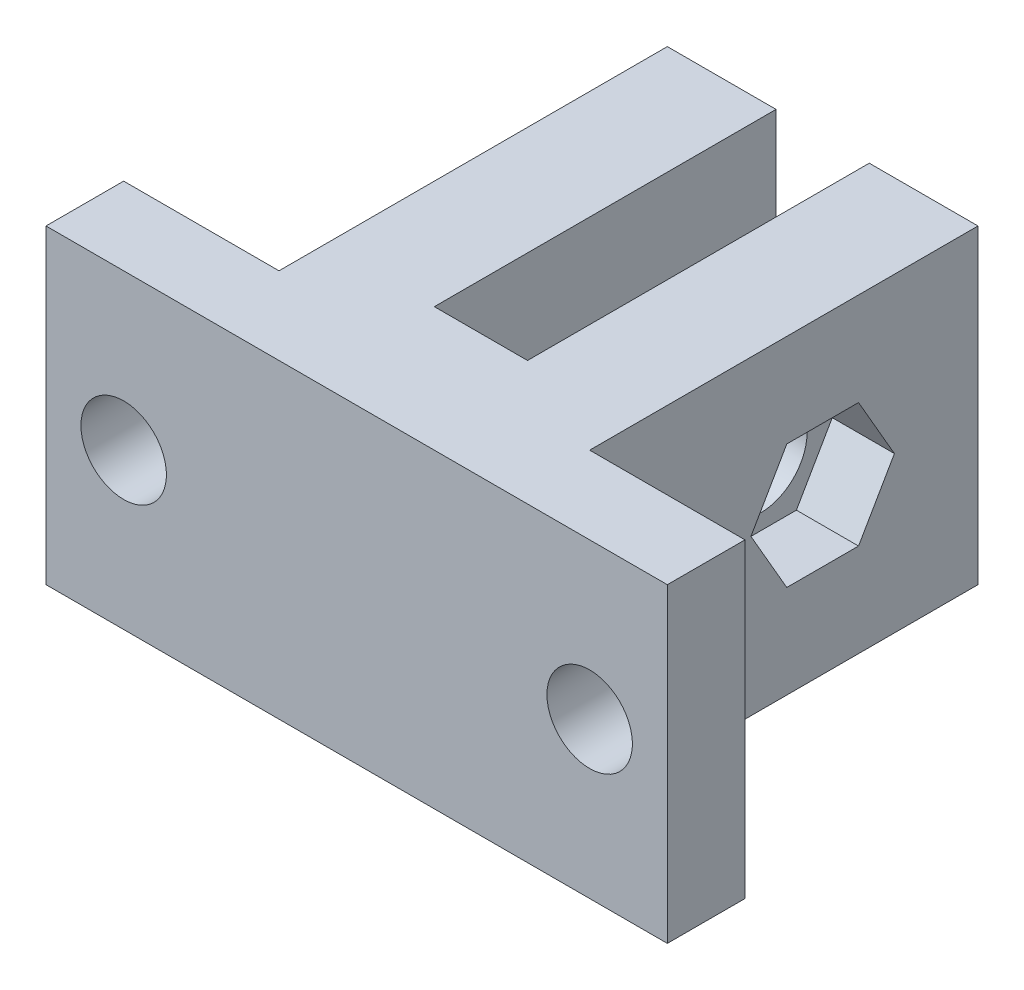
ISO-10303-21;
HEADER;
FILE_DESCRIPTION(('STEP AP214'),'2;1');
FILE_NAME('part.step','',(''),(''),'','','');
FILE_SCHEMA(('AUTOMOTIVE_DESIGN { 1 0 10303 214 1 1 1 1 }'));
ENDSEC;
DATA;
#1=APPLICATION_CONTEXT('core data for automotive mechanical design processes');
#2=APPLICATION_PROTOCOL_DEFINITION('international standard','automotive_design',2000,#1);
#3=PRODUCT_CONTEXT('',#1,'mechanical');
#4=PRODUCT('Part','Part','',(#3));
#5=PRODUCT_RELATED_PRODUCT_CATEGORY('part','',(#4));
#6=PRODUCT_DEFINITION_FORMATION('','',#4);
#7=PRODUCT_DEFINITION_CONTEXT('part definition',#1,'design');
#8=PRODUCT_DEFINITION('design','',#6,#7);
#9=PRODUCT_DEFINITION_SHAPE('','',#8);
#10=(LENGTH_UNIT() NAMED_UNIT(*) SI_UNIT(.MILLI.,.METRE.));
#11=(NAMED_UNIT(*) PLANE_ANGLE_UNIT() SI_UNIT($,.RADIAN.));
#12=(NAMED_UNIT(*) SI_UNIT($,.STERADIAN.) SOLID_ANGLE_UNIT());
#13=UNCERTAINTY_MEASURE_WITH_UNIT(LENGTH_MEASURE(1.E-05),#10,'distance_accuracy_value','');
#14=(GEOMETRIC_REPRESENTATION_CONTEXT(3) GLOBAL_UNCERTAINTY_ASSIGNED_CONTEXT((#13)) GLOBAL_UNIT_ASSIGNED_CONTEXT((#10,
#11,#12)) REPRESENTATION_CONTEXT('',''));
#15=CARTESIAN_POINT('',(0.,0.,0.));
#16=DIRECTION('',(0.,0.,1.));
#17=DIRECTION('',(1.,0.,0.));
#18=AXIS2_PLACEMENT_3D('',#15,#16,#17);
#19=CARTESIAN_POINT('',(40.,10.,10.));
#20=DIRECTION('',(-1.,0.,0.));
#21=DIRECTION('',(0.,0.,1.));
#22=AXIS2_PLACEMENT_3D('',#19,#20,#21);
#23=CYLINDRICAL_SURFACE('',#22,3.);
#24=CARTESIAN_POINT('',(23.,10.,10.));
#25=DIRECTION('',(1.,0.,0.));
#26=DIRECTION('',(0.,0.,-1.));
#27=AXIS2_PLACEMENT_3D('',#24,#25,#26);
#28=CIRCLE('',#27,3.);
#29=CARTESIAN_POINT('',(23.,10.,7.));
#30=VERTEX_POINT('',#29);
#31=EDGE_CURVE('E313',#30,#30,#28,.F.);
#32=ORIENTED_EDGE('',*,*,#31,.T.);
#33=EDGE_LOOP('',(#32));
#34=FACE_BOUND('',#33,.T.);
#35=CARTESIAN_POINT('',(26.,10.,10.));
#36=DIRECTION('',(1.,0.,0.));
#37=DIRECTION('',(0.,0.,-1.));
#38=AXIS2_PLACEMENT_3D('',#35,#36,#37);
#39=CIRCLE('',#38,3.);
#40=CARTESIAN_POINT('',(26.,10.,7.));
#41=VERTEX_POINT('',#40);
#42=EDGE_CURVE('E37',#41,#41,#39,.F.);
#43=ORIENTED_EDGE('',*,*,#42,.F.);
#44=EDGE_LOOP('',(#43));
#45=FACE_BOUND('',#44,.T.);
#46=ADVANCED_FACE('F33',(#34,#45),#23,.F.);
#47=CARTESIAN_POINT('',(0.,0.,30.));
#48=DIRECTION('',(1.,0.,0.));
#49=DIRECTION('',(0.,0.,-1.));
#50=AXIS2_PLACEMENT_3D('',#47,#48,#49);
#51=PLANE('',#50);
#52=DIRECTION('',(0.,1.,0.));
#53=VECTOR('',#52,1.);
#54=CARTESIAN_POINT('',(0.,0.,25.));
#55=LINE('',#54,#53);
#56=CARTESIAN_POINT('',(0.,0.,25.));
#57=VERTEX_POINT('',#56);
#58=CARTESIAN_POINT('',(0.,20.,25.));
#59=VERTEX_POINT('',#58);
#60=EDGE_CURVE('E228',#57,#59,#55,.T.);
#61=ORIENTED_EDGE('',*,*,#60,.F.);
#62=DIRECTION('',(0.,0.,-1.));
#63=VECTOR('',#62,1.);
#64=CARTESIAN_POINT('',(0.,0.,30.));
#65=LINE('',#64,#63);
#66=CARTESIAN_POINT('',(0.,0.,30.));
#67=VERTEX_POINT('',#66);
#68=EDGE_CURVE('E11',#67,#57,#65,.T.);
#69=ORIENTED_EDGE('',*,*,#68,.F.);
#70=DIRECTION('',(0.,-1.,0.));
#71=VECTOR('',#70,1.);
#72=CARTESIAN_POINT('',(0.,0.,30.));
#73=LINE('',#72,#71);
#74=CARTESIAN_POINT('',(0.,20.,30.));
#75=VERTEX_POINT('',#74);
#76=EDGE_CURVE('E288',#75,#67,#73,.T.);
#77=ORIENTED_EDGE('',*,*,#76,.F.);
#78=DIRECTION('',(0.,0.,-1.));
#79=VECTOR('',#78,1.);
#80=CARTESIAN_POINT('',(0.,20.,30.));
#81=LINE('',#80,#79);
#82=EDGE_CURVE('E298',#75,#59,#81,.T.);
#83=ORIENTED_EDGE('',*,*,#82,.T.);
#84=EDGE_LOOP('',(#61,#69,#77,#83));
#85=FACE_BOUND('',#84,.T.);
#86=ADVANCED_FACE('F35',(#85),#51,.F.);
#87=CARTESIAN_POINT('',(0.,0.,0.));
#88=DIRECTION('',(0.,0.,-1.));
#89=DIRECTION('',(-1.,0.,0.));
#90=AXIS2_PLACEMENT_3D('',#87,#88,#89);
#91=PLANE('',#90);
#92=DIRECTION('',(0.,1.,0.));
#93=VECTOR('',#92,1.);
#94=CARTESIAN_POINT('',(30.,0.,0.));
#95=LINE('',#94,#93);
#96=CARTESIAN_POINT('',(30.,0.,0.));
#97=VERTEX_POINT('',#96);
#98=CARTESIAN_POINT('',(30.,20.,0.));
#99=VERTEX_POINT('',#98);
#100=EDGE_CURVE('E247',#97,#99,#95,.T.);
#101=ORIENTED_EDGE('',*,*,#100,.F.);
#102=DIRECTION('',(1.,0.,0.));
#103=VECTOR('',#102,1.);
#104=CARTESIAN_POINT('',(0.,0.,0.));
#105=LINE('',#104,#103);
#106=CARTESIAN_POINT('',(23.,0.,0.));
#107=VERTEX_POINT('',#106);
#108=EDGE_CURVE('E302',#107,#97,#105,.T.);
#109=ORIENTED_EDGE('',*,*,#108,.F.);
#110=DIRECTION('',(0.,1.,0.));
#111=VECTOR('',#110,1.);
#112=CARTESIAN_POINT('',(23.,0.,0.));
#113=LINE('',#112,#111);
#114=CARTESIAN_POINT('',(23.,20.,0.));
#115=VERTEX_POINT('',#114);
#116=EDGE_CURVE('E271',#107,#115,#113,.T.);
#117=ORIENTED_EDGE('',*,*,#116,.T.);
#118=DIRECTION('',(-1.,0.,0.));
#119=VECTOR('',#118,1.);
#120=CARTESIAN_POINT('',(0.,20.,0.));
#121=LINE('',#120,#119);
#122=EDGE_CURVE('E292',#99,#115,#121,.T.);
#123=ORIENTED_EDGE('',*,*,#122,.F.);
#124=EDGE_LOOP('',(#101,#109,#117,#123));
#125=FACE_BOUND('',#124,.T.);
#126=ADVANCED_FACE('F342',(#125),#91,.T.);
#127=CARTESIAN_POINT('',(0.,0.,30.));
#128=DIRECTION('',(0.,1.,0.));
#129=DIRECTION('',(0.,0.,1.));
#130=AXIS2_PLACEMENT_3D('',#127,#128,#129);
#131=PLANE('',#130);
#132=DIRECTION('',(-1.,0.,0.));
#133=VECTOR('',#132,1.);
#134=CARTESIAN_POINT('',(0.,0.,25.));
#135=LINE('',#134,#133);
#136=CARTESIAN_POINT('',(10.,0.,25.));
#137=VERTEX_POINT('',#136);
#138=EDGE_CURVE('E236',#137,#57,#135,.T.);
#139=ORIENTED_EDGE('',*,*,#138,.F.);
#140=DIRECTION('',(0.,0.,-1.));
#141=VECTOR('',#140,1.);
#142=CARTESIAN_POINT('',(10.,0.,25.));
#143=LINE('',#142,#141);
#144=CARTESIAN_POINT('',(10.,0.,0.));
#145=VERTEX_POINT('',#144);
#146=EDGE_CURVE('E239',#137,#145,#143,.T.);
#147=ORIENTED_EDGE('',*,*,#146,.T.);
#148=CARTESIAN_POINT('',(17.,0.,0.));
#149=VERTEX_POINT('',#148);
#150=EDGE_CURVE('E299',#145,#149,#105,.T.);
#151=ORIENTED_EDGE('',*,*,#150,.T.);
#152=DIRECTION('',(0.,0.,1.));
#153=VECTOR('',#152,1.);
#154=CARTESIAN_POINT('',(17.,0.,0.));
#155=LINE('',#154,#153);
#156=CARTESIAN_POINT('',(17.,0.,22.));
#157=VERTEX_POINT('',#156);
#158=EDGE_CURVE('E264',#149,#157,#155,.T.);
#159=ORIENTED_EDGE('',*,*,#158,.T.);
#160=DIRECTION('',(1.,0.,0.));
#161=VECTOR('',#160,1.);
#162=CARTESIAN_POINT('',(23.,0.,22.));
#163=LINE('',#162,#161);
#164=CARTESIAN_POINT('',(23.,0.,22.));
#165=VERTEX_POINT('',#164);
#166=EDGE_CURVE('E268',#157,#165,#163,.T.);
#167=ORIENTED_EDGE('',*,*,#166,.T.);
#168=DIRECTION('',(0.,0.,-1.));
#169=VECTOR('',#168,1.);
#170=CARTESIAN_POINT('',(23.,0.,0.));
#171=LINE('',#170,#169);
#172=EDGE_CURVE('E261',#165,#107,#171,.T.);
#173=ORIENTED_EDGE('',*,*,#172,.T.);
#174=ORIENTED_EDGE('',*,*,#108,.T.);
#175=DIRECTION('',(0.,0.,-1.));
#176=VECTOR('',#175,1.);
#177=CARTESIAN_POINT('',(30.,0.,25.));
#178=LINE('',#177,#176);
#179=CARTESIAN_POINT('',(30.,0.,25.));
#180=VERTEX_POINT('',#179);
#181=EDGE_CURVE('E254',#180,#97,#178,.T.);
#182=ORIENTED_EDGE('',*,*,#181,.F.);
#183=DIRECTION('',(-1.,0.,0.));
#184=VECTOR('',#183,1.);
#185=CARTESIAN_POINT('',(40.,0.,25.));
#186=LINE('',#185,#184);
#187=CARTESIAN_POINT('',(40.,0.,25.));
#188=VERTEX_POINT('',#187);
#189=EDGE_CURVE('E246',#188,#180,#186,.T.);
#190=ORIENTED_EDGE('',*,*,#189,.F.);
#191=DIRECTION('',(0.,0.,-1.));
#192=VECTOR('',#191,1.);
#193=CARTESIAN_POINT('',(40.,0.,30.));
#194=LINE('',#193,#192);
#195=CARTESIAN_POINT('',(40.,0.,30.));
#196=VERTEX_POINT('',#195);
#197=EDGE_CURVE('E42',#196,#188,#194,.T.);
#198=ORIENTED_EDGE('',*,*,#197,.F.);
#199=DIRECTION('',(1.,0.,0.));
#200=VECTOR('',#199,1.);
#201=CARTESIAN_POINT('',(0.,0.,30.));
#202=LINE('',#201,#200);
#203=EDGE_CURVE('E291',#67,#196,#202,.T.);
#204=ORIENTED_EDGE('',*,*,#203,.F.);
#205=ORIENTED_EDGE('',*,*,#68,.T.);
#206=EDGE_LOOP('',(#139,#147,#151,#159,#167,#173,#174,#182,#190,#198,#204,#205));
#207=FACE_BOUND('',#206,.T.);
#208=ADVANCED_FACE('F366',(#207),#131,.F.);
#209=CARTESIAN_POINT('',(40.,0.,30.));
#210=DIRECTION('',(-1.,0.,0.));
#211=DIRECTION('',(0.,0.,1.));
#212=AXIS2_PLACEMENT_3D('',#209,#210,#211);
#213=PLANE('',#212);
#214=ORIENTED_EDGE('',*,*,#197,.T.);
#215=DIRECTION('',(0.,-1.,0.));
#216=VECTOR('',#215,1.);
#217=CARTESIAN_POINT('',(40.,0.,25.));
#218=LINE('',#217,#216);
#219=CARTESIAN_POINT('',(40.,20.,25.));
#220=VERTEX_POINT('',#219);
#221=EDGE_CURVE('E244',#220,#188,#218,.T.);
#222=ORIENTED_EDGE('',*,*,#221,.F.);
#223=DIRECTION('',(0.,0.,-1.));
#224=VECTOR('',#223,1.);
#225=CARTESIAN_POINT('',(40.,20.,30.));
#226=LINE('',#225,#224);
#227=CARTESIAN_POINT('',(40.,20.,30.));
#228=VERTEX_POINT('',#227);
#229=EDGE_CURVE('E306',#228,#220,#226,.T.);
#230=ORIENTED_EDGE('',*,*,#229,.F.);
#231=DIRECTION('',(0.,1.,0.));
#232=VECTOR('',#231,1.);
#233=CARTESIAN_POINT('',(40.,0.,30.));
#234=LINE('',#233,#232);
#235=EDGE_CURVE('E294',#196,#228,#234,.T.);
#236=ORIENTED_EDGE('',*,*,#235,.F.);
#237=EDGE_LOOP('',(#214,#222,#230,#236));
#238=FACE_BOUND('',#237,.T.);
#239=ADVANCED_FACE('F371',(#238),#213,.F.);
#240=CARTESIAN_POINT('',(0.,20.,30.));
#241=DIRECTION('',(0.,-1.,0.));
#242=DIRECTION('',(0.,0.,-1.));
#243=AXIS2_PLACEMENT_3D('',#240,#241,#242);
#244=PLANE('',#243);
#245=CARTESIAN_POINT('',(17.,20.,0.));
#246=VERTEX_POINT('',#245);
#247=CARTESIAN_POINT('',(10.,20.,0.));
#248=VERTEX_POINT('',#247);
#249=EDGE_CURVE('E301',#246,#248,#121,.T.);
#250=ORIENTED_EDGE('',*,*,#249,.T.);
#251=DIRECTION('',(0.,0.,-1.));
#252=VECTOR('',#251,1.);
#253=CARTESIAN_POINT('',(10.,20.,25.));
#254=LINE('',#253,#252);
#255=CARTESIAN_POINT('',(10.,20.,25.));
#256=VERTEX_POINT('',#255);
#257=EDGE_CURVE('E58',#256,#248,#254,.T.);
#258=ORIENTED_EDGE('',*,*,#257,.F.);
#259=DIRECTION('',(1.,0.,0.));
#260=VECTOR('',#259,1.);
#261=CARTESIAN_POINT('',(0.,20.,25.));
#262=LINE('',#261,#260);
#263=EDGE_CURVE('E230',#59,#256,#262,.T.);
#264=ORIENTED_EDGE('',*,*,#263,.F.);
#265=ORIENTED_EDGE('',*,*,#82,.F.);
#266=DIRECTION('',(-1.,0.,0.));
#267=VECTOR('',#266,1.);
#268=CARTESIAN_POINT('',(0.,20.,30.));
#269=LINE('',#268,#267);
#270=EDGE_CURVE('E296',#228,#75,#269,.T.);
#271=ORIENTED_EDGE('',*,*,#270,.F.);
#272=ORIENTED_EDGE('',*,*,#229,.T.);
#273=DIRECTION('',(1.,0.,0.));
#274=VECTOR('',#273,1.);
#275=CARTESIAN_POINT('',(40.,20.,25.));
#276=LINE('',#275,#274);
#277=CARTESIAN_POINT('',(30.,20.,25.));
#278=VERTEX_POINT('',#277);
#279=EDGE_CURVE('E252',#278,#220,#276,.T.);
#280=ORIENTED_EDGE('',*,*,#279,.F.);
#281=DIRECTION('',(0.,0.,-1.));
#282=VECTOR('',#281,1.);
#283=CARTESIAN_POINT('',(30.,20.,25.));
#284=LINE('',#283,#282);
#285=EDGE_CURVE('E256',#278,#99,#284,.T.);
#286=ORIENTED_EDGE('',*,*,#285,.T.);
#287=ORIENTED_EDGE('',*,*,#122,.T.);
#288=DIRECTION('',(0.,0.,-1.));
#289=VECTOR('',#288,1.);
#290=CARTESIAN_POINT('',(23.,20.,0.));
#291=LINE('',#290,#289);
#292=CARTESIAN_POINT('',(23.,20.,22.));
#293=VERTEX_POINT('',#292);
#294=EDGE_CURVE('E259',#293,#115,#291,.T.);
#295=ORIENTED_EDGE('',*,*,#294,.F.);
#296=DIRECTION('',(1.,0.,0.));
#297=VECTOR('',#296,1.);
#298=CARTESIAN_POINT('',(23.,20.,22.));
#299=LINE('',#298,#297);
#300=CARTESIAN_POINT('',(17.,20.,22.));
#301=VERTEX_POINT('',#300);
#302=EDGE_CURVE('E265',#301,#293,#299,.T.);
#303=ORIENTED_EDGE('',*,*,#302,.F.);
#304=DIRECTION('',(0.,0.,1.));
#305=VECTOR('',#304,1.);
#306=CARTESIAN_POINT('',(17.,20.,0.));
#307=LINE('',#306,#305);
#308=EDGE_CURVE('E274',#246,#301,#307,.T.);
#309=ORIENTED_EDGE('',*,*,#308,.F.);
#310=EDGE_LOOP('',(#250,#258,#264,#265,#271,#272,#280,#286,#287,#295,#303,#309));
#311=FACE_BOUND('',#310,.T.);
#312=ADVANCED_FACE('F362',(#311),#244,.F.);
#313=CARTESIAN_POINT('',(0.,0.,30.));
#314=DIRECTION('',(0.,0.,-1.));
#315=DIRECTION('',(-1.,0.,0.));
#316=AXIS2_PLACEMENT_3D('',#313,#314,#315);
#317=PLANE('',#316);
#318=CARTESIAN_POINT('',(5.,10.,30.));
#319=DIRECTION('',(0.,0.,-1.));
#320=DIRECTION('',(-1.,0.,0.));
#321=AXIS2_PLACEMENT_3D('',#318,#319,#320);
#322=CIRCLE('',#321,2.75);
#323=CARTESIAN_POINT('',(2.25,10.,30.));
#324=VERTEX_POINT('',#323);
#325=EDGE_CURVE('E215',#324,#324,#322,.T.);
#326=ORIENTED_EDGE('',*,*,#325,.T.);
#327=EDGE_LOOP('',(#326));
#328=FACE_BOUND('',#327,.T.);
#329=CARTESIAN_POINT('',(35.,10.,30.));
#330=DIRECTION('',(0.,0.,-1.));
#331=DIRECTION('',(-1.,0.,0.));
#332=AXIS2_PLACEMENT_3D('',#329,#330,#331);
#333=CIRCLE('',#332,2.75);
#334=CARTESIAN_POINT('',(32.25,10.,30.));
#335=VERTEX_POINT('',#334);
#336=EDGE_CURVE('E222',#335,#335,#333,.T.);
#337=ORIENTED_EDGE('',*,*,#336,.T.);
#338=EDGE_LOOP('',(#337));
#339=FACE_BOUND('',#338,.T.);
#340=ORIENTED_EDGE('',*,*,#76,.T.);
#341=ORIENTED_EDGE('',*,*,#203,.T.);
#342=ORIENTED_EDGE('',*,*,#235,.T.);
#343=ORIENTED_EDGE('',*,*,#270,.T.);
#344=EDGE_LOOP('',(#340,#341,#342,#343));
#345=FACE_BOUND('',#344,.T.);
#346=ADVANCED_FACE('F356',(#328,#339,#345),#317,.F.);
#347=DIRECTION('',(0.,-1.,0.));
#348=VECTOR('',#347,1.);
#349=CARTESIAN_POINT('',(10.,0.,0.));
#350=LINE('',#349,#348);
#351=EDGE_CURVE('E225',#248,#145,#350,.T.);
#352=ORIENTED_EDGE('',*,*,#351,.F.);
#353=ORIENTED_EDGE('',*,*,#249,.F.);
#354=DIRECTION('',(0.,1.,0.));
#355=VECTOR('',#354,1.);
#356=CARTESIAN_POINT('',(17.,0.,0.));
#357=LINE('',#356,#355);
#358=EDGE_CURVE('E284',#149,#246,#357,.T.);
#359=ORIENTED_EDGE('',*,*,#358,.F.);
#360=ORIENTED_EDGE('',*,*,#150,.F.);
#361=EDGE_LOOP('',(#352,#353,#359,#360));
#362=FACE_BOUND('',#361,.T.);
#363=ADVANCED_FACE('F349',(#362),#91,.T.);
#364=CARTESIAN_POINT('',(10.,10.,10.));
#365=DIRECTION('',(1.,0.,0.));
#366=DIRECTION('',(0.,0.,-1.));
#367=AXIS2_PLACEMENT_3D('',#364,#365,#366);
#368=CIRCLE('',#367,3.);
#369=CARTESIAN_POINT('',(10.,10.,7.));
#370=VERTEX_POINT('',#369);
#371=EDGE_CURVE('E242',#370,#370,#368,.F.);
#372=ORIENTED_EDGE('',*,*,#371,.T.);
#373=EDGE_LOOP('',(#372));
#374=FACE_BOUND('',#373,.T.);
#375=CARTESIAN_POINT('',(17.,10.,10.));
#376=DIRECTION('',(-1.,0.,0.));
#377=DIRECTION('',(0.,0.,1.));
#378=AXIS2_PLACEMENT_3D('',#375,#376,#377);
#379=CIRCLE('',#378,3.);
#380=CARTESIAN_POINT('',(17.,10.,13.));
#381=VERTEX_POINT('',#380);
#382=EDGE_CURVE('E281',#381,#381,#379,.F.);
#383=ORIENTED_EDGE('',*,*,#382,.T.);
#384=EDGE_LOOP('',(#383));
#385=FACE_BOUND('',#384,.T.);
#386=ADVANCED_FACE('F318',(#374,#385),#23,.F.);
#387=CARTESIAN_POINT('',(23.,0.,0.));
#388=DIRECTION('',(1.,0.,0.));
#389=DIRECTION('',(0.,0.,-1.));
#390=AXIS2_PLACEMENT_3D('',#387,#388,#389);
#391=PLANE('',#390);
#392=ORIENTED_EDGE('',*,*,#294,.T.);
#393=ORIENTED_EDGE('',*,*,#116,.F.);
#394=ORIENTED_EDGE('',*,*,#172,.F.);
#395=DIRECTION('',(0.,1.,0.));
#396=VECTOR('',#395,1.);
#397=CARTESIAN_POINT('',(23.,0.,22.));
#398=LINE('',#397,#396);
#399=EDGE_CURVE('E279',#165,#293,#398,.T.);
#400=ORIENTED_EDGE('',*,*,#399,.T.);
#401=EDGE_LOOP('',(#392,#393,#394,#400));
#402=FACE_BOUND('',#401,.T.);
#403=ORIENTED_EDGE('',*,*,#31,.F.);
#404=EDGE_LOOP('',(#403));
#405=FACE_BOUND('',#404,.T.);
#406=ADVANCED_FACE('F348',(#402,#405),#391,.F.);
#407=CARTESIAN_POINT('',(17.,0.,0.));
#408=DIRECTION('',(-1.,0.,0.));
#409=DIRECTION('',(0.,0.,1.));
#410=AXIS2_PLACEMENT_3D('',#407,#408,#409);
#411=PLANE('',#410);
#412=ORIENTED_EDGE('',*,*,#308,.T.);
#413=DIRECTION('',(0.,1.,0.));
#414=VECTOR('',#413,1.);
#415=CARTESIAN_POINT('',(17.,0.,22.));
#416=LINE('',#415,#414);
#417=EDGE_CURVE('E282',#157,#301,#416,.T.);
#418=ORIENTED_EDGE('',*,*,#417,.F.);
#419=ORIENTED_EDGE('',*,*,#158,.F.);
#420=ORIENTED_EDGE('',*,*,#358,.T.);
#421=EDGE_LOOP('',(#412,#418,#419,#420));
#422=FACE_BOUND('',#421,.T.);
#423=ORIENTED_EDGE('',*,*,#382,.F.);
#424=EDGE_LOOP('',(#423));
#425=FACE_BOUND('',#424,.T.);
#426=ADVANCED_FACE('F354',(#422,#425),#411,.F.);
#427=CARTESIAN_POINT('',(23.,0.,22.));
#428=DIRECTION('',(0.,0.,1.));
#429=DIRECTION('',(1.,0.,0.));
#430=AXIS2_PLACEMENT_3D('',#427,#428,#429);
#431=PLANE('',#430);
#432=ORIENTED_EDGE('',*,*,#302,.T.);
#433=ORIENTED_EDGE('',*,*,#399,.F.);
#434=ORIENTED_EDGE('',*,*,#166,.F.);
#435=ORIENTED_EDGE('',*,*,#417,.T.);
#436=EDGE_LOOP('',(#432,#433,#434,#435));
#437=FACE_BOUND('',#436,.T.);
#438=ADVANCED_FACE('F412',(#437),#431,.F.);
#439=CARTESIAN_POINT('',(30.,0.,25.));
#440=DIRECTION('',(-1.,0.,0.));
#441=DIRECTION('',(0.,0.,1.));
#442=AXIS2_PLACEMENT_3D('',#439,#440,#441);
#443=PLANE('',#442);
#444=DIRECTION('',(0.,0.,1.));
#445=VECTOR('',#444,1.);
#446=CARTESIAN_POINT('',(30.,14.,7.6905989232415));
#447=LINE('',#446,#445);
#448=CARTESIAN_POINT('',(30.,14.,7.6905989232415));
#449=VERTEX_POINT('',#448);
#450=CARTESIAN_POINT('',(30.,14.,12.3094010767585));
#451=VERTEX_POINT('',#450);
#452=EDGE_CURVE('E196',#449,#451,#447,.T.);
#453=ORIENTED_EDGE('',*,*,#452,.F.);
#454=DIRECTION('',(0.,0.866025403784439,0.5));
#455=VECTOR('',#454,1.);
#456=CARTESIAN_POINT('',(30.,10.,5.38119784648299));
#457=LINE('',#456,#455);
#458=CARTESIAN_POINT('',(30.,10.,5.38119784648299));
#459=VERTEX_POINT('',#458);
#460=EDGE_CURVE('E50',#459,#449,#457,.T.);
#461=ORIENTED_EDGE('',*,*,#460,.F.);
#462=DIRECTION('',(0.,0.866025403784438,-0.5));
#463=VECTOR('',#462,1.);
#464=CARTESIAN_POINT('',(30.,6.,7.6905989232415));
#465=LINE('',#464,#463);
#466=CARTESIAN_POINT('',(30.,6.,7.6905989232415));
#467=VERTEX_POINT('',#466);
#468=EDGE_CURVE('E182',#467,#459,#465,.T.);
#469=ORIENTED_EDGE('',*,*,#468,.F.);
#470=DIRECTION('',(0.,0.,-1.));
#471=VECTOR('',#470,1.);
#472=CARTESIAN_POINT('',(30.,6.,12.3094010767585));
#473=LINE('',#472,#471);
#474=CARTESIAN_POINT('',(30.,6.,12.3094010767585));
#475=VERTEX_POINT('',#474);
#476=EDGE_CURVE('E185',#475,#467,#473,.T.);
#477=ORIENTED_EDGE('',*,*,#476,.F.);
#478=DIRECTION('',(0.,-0.866025403784439,-0.5));
#479=VECTOR('',#478,1.);
#480=CARTESIAN_POINT('',(30.,10.,14.618802153517));
#481=LINE('',#480,#479);
#482=CARTESIAN_POINT('',(30.,10.,14.618802153517));
#483=VERTEX_POINT('',#482);
#484=EDGE_CURVE('E201',#483,#475,#481,.T.);
#485=ORIENTED_EDGE('',*,*,#484,.F.);
#486=DIRECTION('',(0.,-0.866025403784438,0.5));
#487=VECTOR('',#486,1.);
#488=CARTESIAN_POINT('',(30.,14.,12.3094010767585));
#489=LINE('',#488,#487);
#490=EDGE_CURVE('E198',#451,#483,#489,.T.);
#491=ORIENTED_EDGE('',*,*,#490,.F.);
#492=EDGE_LOOP('',(#453,#461,#469,#477,#485,#491));
#493=FACE_BOUND('',#492,.T.);
#494=ORIENTED_EDGE('',*,*,#100,.T.);
#495=ORIENTED_EDGE('',*,*,#285,.F.);
#496=DIRECTION('',(0.,1.,0.));
#497=VECTOR('',#496,1.);
#498=CARTESIAN_POINT('',(30.,0.,25.));
#499=LINE('',#498,#497);
#500=EDGE_CURVE('E250',#180,#278,#499,.T.);
#501=ORIENTED_EDGE('',*,*,#500,.F.);
#502=ORIENTED_EDGE('',*,*,#181,.T.);
#503=EDGE_LOOP('',(#494,#495,#501,#502));
#504=FACE_BOUND('',#503,.T.);
#505=ADVANCED_FACE('F333',(#493,#504),#443,.F.);
#506=CARTESIAN_POINT('',(0.,0.,25.));
#507=DIRECTION('',(0.,0.,1.));
#508=DIRECTION('',(1.,0.,0.));
#509=AXIS2_PLACEMENT_3D('',#506,#507,#508);
#510=PLANE('',#509);
#511=CARTESIAN_POINT('',(35.,10.,25.));
#512=DIRECTION('',(0.,0.,-1.));
#513=DIRECTION('',(-1.,0.,0.));
#514=AXIS2_PLACEMENT_3D('',#511,#512,#513);
#515=CIRCLE('',#514,2.75);
#516=CARTESIAN_POINT('',(32.25,10.,25.));
#517=VERTEX_POINT('',#516);
#518=EDGE_CURVE('E218',#517,#517,#515,.T.);
#519=ORIENTED_EDGE('',*,*,#518,.F.);
#520=EDGE_LOOP('',(#519));
#521=FACE_BOUND('',#520,.T.);
#522=ORIENTED_EDGE('',*,*,#221,.T.);
#523=ORIENTED_EDGE('',*,*,#189,.T.);
#524=ORIENTED_EDGE('',*,*,#500,.T.);
#525=ORIENTED_EDGE('',*,*,#279,.T.);
#526=EDGE_LOOP('',(#522,#523,#524,#525));
#527=FACE_BOUND('',#526,.T.);
#528=ADVANCED_FACE('F324',(#521,#527),#510,.F.);
#529=CARTESIAN_POINT('',(10.,0.,25.));
#530=DIRECTION('',(1.,0.,0.));
#531=DIRECTION('',(0.,0.,-1.));
#532=AXIS2_PLACEMENT_3D('',#529,#530,#531);
#533=PLANE('',#532);
#534=ORIENTED_EDGE('',*,*,#351,.T.);
#535=ORIENTED_EDGE('',*,*,#146,.F.);
#536=DIRECTION('',(0.,-1.,0.));
#537=VECTOR('',#536,1.);
#538=CARTESIAN_POINT('',(10.,0.,25.));
#539=LINE('',#538,#537);
#540=EDGE_CURVE('E233',#256,#137,#539,.T.);
#541=ORIENTED_EDGE('',*,*,#540,.F.);
#542=ORIENTED_EDGE('',*,*,#257,.T.);
#543=EDGE_LOOP('',(#534,#535,#541,#542));
#544=FACE_BOUND('',#543,.T.);
#545=ORIENTED_EDGE('',*,*,#371,.F.);
#546=EDGE_LOOP('',(#545));
#547=FACE_BOUND('',#546,.T.);
#548=ADVANCED_FACE('F321',(#544,#547),#533,.F.);
#549=CARTESIAN_POINT('',(0.,0.,25.));
#550=DIRECTION('',(0.,0.,-1.));
#551=DIRECTION('',(-1.,0.,0.));
#552=AXIS2_PLACEMENT_3D('',#549,#550,#551);
#553=PLANE('',#552);
#554=CARTESIAN_POINT('',(5.,10.,25.));
#555=DIRECTION('',(0.,0.,-1.));
#556=DIRECTION('',(-1.,0.,0.));
#557=AXIS2_PLACEMENT_3D('',#554,#555,#556);
#558=CIRCLE('',#557,2.75);
#559=CARTESIAN_POINT('',(2.25,10.,25.));
#560=VERTEX_POINT('',#559);
#561=EDGE_CURVE('E219',#560,#560,#558,.T.);
#562=ORIENTED_EDGE('',*,*,#561,.F.);
#563=EDGE_LOOP('',(#562));
#564=FACE_BOUND('',#563,.T.);
#565=ORIENTED_EDGE('',*,*,#60,.T.);
#566=ORIENTED_EDGE('',*,*,#263,.T.);
#567=ORIENTED_EDGE('',*,*,#540,.T.);
#568=ORIENTED_EDGE('',*,*,#138,.T.);
#569=EDGE_LOOP('',(#565,#566,#567,#568));
#570=FACE_BOUND('',#569,.T.);
#571=ADVANCED_FACE('F323',(#564,#570),#553,.T.);
#572=CARTESIAN_POINT('',(35.,10.,30.));
#573=DIRECTION('',(0.,0.,-1.));
#574=DIRECTION('',(-1.,0.,0.));
#575=AXIS2_PLACEMENT_3D('',#572,#573,#574);
#576=CYLINDRICAL_SURFACE('',#575,2.75);
#577=ORIENTED_EDGE('',*,*,#336,.F.);
#578=EDGE_LOOP('',(#577));
#579=FACE_BOUND('',#578,.T.);
#580=ORIENTED_EDGE('',*,*,#518,.T.);
#581=EDGE_LOOP('',(#580));
#582=FACE_BOUND('',#581,.T.);
#583=ADVANCED_FACE('F330',(#579,#582),#576,.F.);
#584=CARTESIAN_POINT('',(5.,10.,30.));
#585=DIRECTION('',(0.,0.,-1.));
#586=DIRECTION('',(-1.,0.,0.));
#587=AXIS2_PLACEMENT_3D('',#584,#585,#586);
#588=CYLINDRICAL_SURFACE('',#587,2.75);
#589=ORIENTED_EDGE('',*,*,#325,.F.);
#590=EDGE_LOOP('',(#589));
#591=FACE_BOUND('',#590,.T.);
#592=ORIENTED_EDGE('',*,*,#561,.T.);
#593=EDGE_LOOP('',(#592));
#594=FACE_BOUND('',#593,.T.);
#595=ADVANCED_FACE('F474',(#591,#594),#588,.F.);
#596=CARTESIAN_POINT('',(26.,0.,0.));
#597=DIRECTION('',(1.,0.,0.));
#598=DIRECTION('',(0.,0.,-1.));
#599=AXIS2_PLACEMENT_3D('',#596,#597,#598);
#600=PLANE('',#599);
#601=DIRECTION('',(0.,0.866025403784439,0.5));
#602=VECTOR('',#601,1.);
#603=CARTESIAN_POINT('',(26.,10.,5.38119784648299));
#604=LINE('',#603,#602);
#605=CARTESIAN_POINT('',(26.,10.,5.38119784648299));
#606=VERTEX_POINT('',#605);
#607=CARTESIAN_POINT('',(26.,14.,7.6905989232415));
#608=VERTEX_POINT('',#607);
#609=EDGE_CURVE('E162',#606,#608,#604,.T.);
#610=ORIENTED_EDGE('',*,*,#609,.T.);
#611=DIRECTION('',(0.,0.,1.));
#612=VECTOR('',#611,1.);
#613=CARTESIAN_POINT('',(26.,14.,7.6905989232415));
#614=LINE('',#613,#612);
#615=CARTESIAN_POINT('',(26.,14.,12.3094010767585));
#616=VERTEX_POINT('',#615);
#617=EDGE_CURVE('E171',#608,#616,#614,.T.);
#618=ORIENTED_EDGE('',*,*,#617,.T.);
#619=DIRECTION('',(0.,-0.866025403784438,0.5));
#620=VECTOR('',#619,1.);
#621=CARTESIAN_POINT('',(26.,14.,12.3094010767585));
#622=LINE('',#621,#620);
#623=CARTESIAN_POINT('',(26.,10.,14.618802153517));
#624=VERTEX_POINT('',#623);
#625=EDGE_CURVE('E176',#616,#624,#622,.T.);
#626=ORIENTED_EDGE('',*,*,#625,.T.);
#627=DIRECTION('',(0.,-0.866025403784439,-0.5));
#628=VECTOR('',#627,1.);
#629=CARTESIAN_POINT('',(26.,10.,14.618802153517));
#630=LINE('',#629,#628);
#631=CARTESIAN_POINT('',(26.,6.,12.3094010767585));
#632=VERTEX_POINT('',#631);
#633=EDGE_CURVE('E189',#624,#632,#630,.T.);
#634=ORIENTED_EDGE('',*,*,#633,.T.);
#635=DIRECTION('',(0.,0.,-1.));
#636=VECTOR('',#635,1.);
#637=CARTESIAN_POINT('',(26.,6.,12.3094010767585));
#638=LINE('',#637,#636);
#639=CARTESIAN_POINT('',(26.,6.,7.6905989232415));
#640=VERTEX_POINT('',#639);
#641=EDGE_CURVE('E192',#632,#640,#638,.T.);
#642=ORIENTED_EDGE('',*,*,#641,.T.);
#643=DIRECTION('',(0.,0.866025403784438,-0.5));
#644=VECTOR('',#643,1.);
#645=CARTESIAN_POINT('',(26.,6.,7.6905989232415));
#646=LINE('',#645,#644);
#647=EDGE_CURVE('E168',#640,#606,#646,.T.);
#648=ORIENTED_EDGE('',*,*,#647,.T.);
#649=EDGE_LOOP('',(#610,#618,#626,#634,#642,#648));
#650=FACE_BOUND('',#649,.T.);
#651=ORIENTED_EDGE('',*,*,#42,.T.);
#652=EDGE_LOOP('',(#651));
#653=FACE_BOUND('',#652,.T.);
#654=ADVANCED_FACE('F178',(#650,#653),#600,.T.);
#655=CARTESIAN_POINT('',(26.,10.,5.38119784648299));
#656=DIRECTION('',(0.,0.5,-0.866025403784439));
#657=DIRECTION('',(0.,0.866025403784439,0.5));
#658=AXIS2_PLACEMENT_3D('',#655,#656,#657);
#659=PLANE('',#658);
#660=ORIENTED_EDGE('',*,*,#460,.T.);
#661=DIRECTION('',(1.,0.,0.));
#662=VECTOR('',#661,1.);
#663=CARTESIAN_POINT('',(26.,14.,7.6905989232415));
#664=LINE('',#663,#662);
#665=EDGE_CURVE('E158',#608,#449,#664,.T.);
#666=ORIENTED_EDGE('',*,*,#665,.F.);
#667=ORIENTED_EDGE('',*,*,#609,.F.);
#668=DIRECTION('',(1.,0.,0.));
#669=VECTOR('',#668,1.);
#670=CARTESIAN_POINT('',(26.,10.,5.38119784648299));
#671=LINE('',#670,#669);
#672=EDGE_CURVE('E206',#606,#459,#671,.T.);
#673=ORIENTED_EDGE('',*,*,#672,.T.);
#674=EDGE_LOOP('',(#660,#666,#667,#673));
#675=FACE_BOUND('',#674,.T.);
#676=ADVANCED_FACE('F160',(#675),#659,.F.);
#677=CARTESIAN_POINT('',(26.,6.,7.6905989232415));
#678=DIRECTION('',(0.,-0.5,-0.866025403784438));
#679=DIRECTION('',(0.,0.866025403784438,-0.5));
#680=AXIS2_PLACEMENT_3D('',#677,#678,#679);
#681=PLANE('',#680);
#682=ORIENTED_EDGE('',*,*,#468,.T.);
#683=ORIENTED_EDGE('',*,*,#672,.F.);
#684=ORIENTED_EDGE('',*,*,#647,.F.);
#685=DIRECTION('',(1.,0.,0.));
#686=VECTOR('',#685,1.);
#687=CARTESIAN_POINT('',(26.,6.,7.6905989232415));
#688=LINE('',#687,#686);
#689=EDGE_CURVE('E208',#640,#467,#688,.T.);
#690=ORIENTED_EDGE('',*,*,#689,.T.);
#691=EDGE_LOOP('',(#682,#683,#684,#690));
#692=FACE_BOUND('',#691,.T.);
#693=ADVANCED_FACE('F501',(#692),#681,.F.);
#694=CARTESIAN_POINT('',(26.,6.,12.3094010767585));
#695=DIRECTION('',(0.,-1.,0.));
#696=DIRECTION('',(0.,0.,-1.));
#697=AXIS2_PLACEMENT_3D('',#694,#695,#696);
#698=PLANE('',#697);
#699=ORIENTED_EDGE('',*,*,#476,.T.);
#700=ORIENTED_EDGE('',*,*,#689,.F.);
#701=ORIENTED_EDGE('',*,*,#641,.F.);
#702=DIRECTION('',(1.,0.,0.));
#703=VECTOR('',#702,1.);
#704=CARTESIAN_POINT('',(26.,6.,12.3094010767585));
#705=LINE('',#704,#703);
#706=EDGE_CURVE('E210',#632,#475,#705,.T.);
#707=ORIENTED_EDGE('',*,*,#706,.T.);
#708=EDGE_LOOP('',(#699,#700,#701,#707));
#709=FACE_BOUND('',#708,.T.);
#710=ADVANCED_FACE('F509',(#709),#698,.F.);
#711=CARTESIAN_POINT('',(26.,10.,14.618802153517));
#712=DIRECTION('',(0.,-0.5,0.866025403784439));
#713=DIRECTION('',(0.,-0.866025403784439,-0.5));
#714=AXIS2_PLACEMENT_3D('',#711,#712,#713);
#715=PLANE('',#714);
#716=ORIENTED_EDGE('',*,*,#484,.T.);
#717=ORIENTED_EDGE('',*,*,#706,.F.);
#718=ORIENTED_EDGE('',*,*,#633,.F.);
#719=DIRECTION('',(1.,0.,0.));
#720=VECTOR('',#719,1.);
#721=CARTESIAN_POINT('',(26.,10.,14.618802153517));
#722=LINE('',#721,#720);
#723=EDGE_CURVE('E212',#624,#483,#722,.T.);
#724=ORIENTED_EDGE('',*,*,#723,.T.);
#725=EDGE_LOOP('',(#716,#717,#718,#724));
#726=FACE_BOUND('',#725,.T.);
#727=ADVANCED_FACE('F518',(#726),#715,.F.);
#728=CARTESIAN_POINT('',(26.,14.,12.3094010767585));
#729=DIRECTION('',(0.,0.5,0.866025403784438));
#730=DIRECTION('',(0.,-0.866025403784438,0.5));
#731=AXIS2_PLACEMENT_3D('',#728,#729,#730);
#732=PLANE('',#731);
#733=ORIENTED_EDGE('',*,*,#490,.T.);
#734=ORIENTED_EDGE('',*,*,#723,.F.);
#735=ORIENTED_EDGE('',*,*,#625,.F.);
#736=DIRECTION('',(1.,0.,0.));
#737=VECTOR('',#736,1.);
#738=CARTESIAN_POINT('',(26.,14.,12.3094010767585));
#739=LINE('',#738,#737);
#740=EDGE_CURVE('E167',#616,#451,#739,.T.);
#741=ORIENTED_EDGE('',*,*,#740,.T.);
#742=EDGE_LOOP('',(#733,#734,#735,#741));
#743=FACE_BOUND('',#742,.T.);
#744=ADVANCED_FACE('F527',(#743),#732,.F.);
#745=CARTESIAN_POINT('',(26.,14.,7.6905989232415));
#746=DIRECTION('',(0.,1.,0.));
#747=DIRECTION('',(0.,0.,1.));
#748=AXIS2_PLACEMENT_3D('',#745,#746,#747);
#749=PLANE('',#748);
#750=ORIENTED_EDGE('',*,*,#452,.T.);
#751=ORIENTED_EDGE('',*,*,#740,.F.);
#752=ORIENTED_EDGE('',*,*,#617,.F.);
#753=ORIENTED_EDGE('',*,*,#665,.T.);
#754=EDGE_LOOP('',(#750,#751,#752,#753));
#755=FACE_BOUND('',#754,.T.);
#756=ADVANCED_FACE('F172',(#755),#749,.F.);
#757=CLOSED_SHELL('',(#46,#86,#126,#208,#239,#312,#346,#363,#386,#406,#426,#438,#505,#528,#548,
#571,#583,#595,#654,#676,#693,#710,#727,#744,#756));
#758=MANIFOLD_SOLID_BREP('B2',#757);
#759=ADVANCED_BREP_SHAPE_REPRESENTATION('',(#18,#758),#14);
#760=SHAPE_DEFINITION_REPRESENTATION(#9,#759);
ENDSEC;
END-ISO-10303-21;
